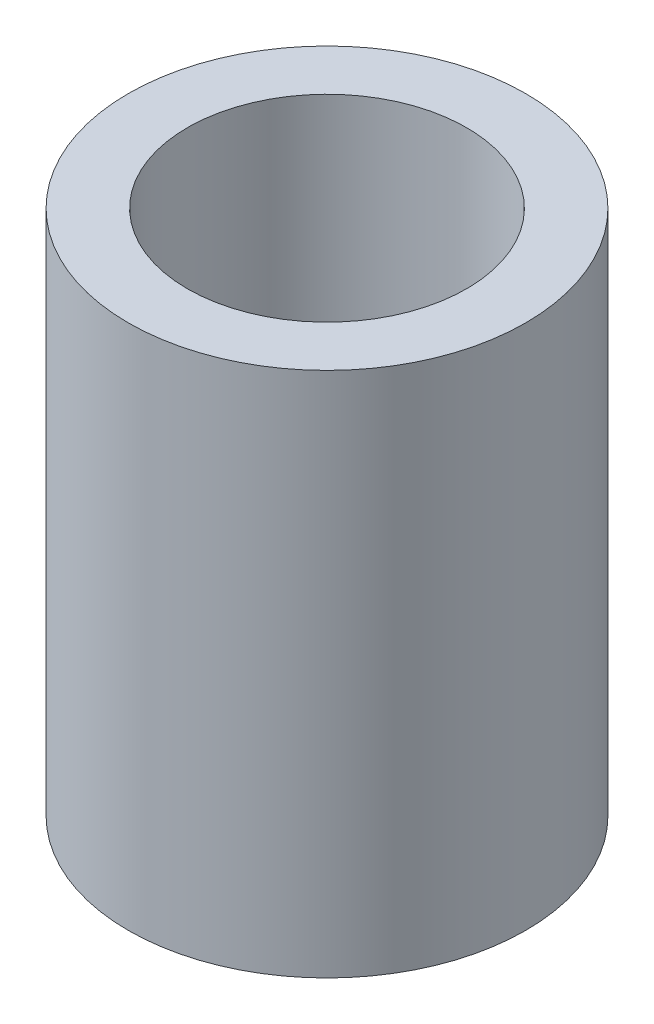
ISO-10303-21;
HEADER;
FILE_DESCRIPTION(('STEP AP214'),'2;1');
FILE_NAME('part.step','',(''),(''),'','','');
FILE_SCHEMA(('AUTOMOTIVE_DESIGN { 1 0 10303 214 1 1 1 1 }'));
ENDSEC;
DATA;
#1=APPLICATION_CONTEXT('core data for automotive mechanical design processes');
#2=APPLICATION_PROTOCOL_DEFINITION('international standard','automotive_design',2000,#1);
#3=PRODUCT_CONTEXT('',#1,'mechanical');
#4=PRODUCT('Part','Part','',(#3));
#5=PRODUCT_RELATED_PRODUCT_CATEGORY('part','',(#4));
#6=PRODUCT_DEFINITION_FORMATION('','',#4);
#7=PRODUCT_DEFINITION_CONTEXT('part definition',#1,'design');
#8=PRODUCT_DEFINITION('design','',#6,#7);
#9=PRODUCT_DEFINITION_SHAPE('','',#8);
#10=(LENGTH_UNIT() NAMED_UNIT(*) SI_UNIT(.MILLI.,.METRE.));
#11=(NAMED_UNIT(*) PLANE_ANGLE_UNIT() SI_UNIT($,.RADIAN.));
#12=(NAMED_UNIT(*) SI_UNIT($,.STERADIAN.) SOLID_ANGLE_UNIT());
#13=UNCERTAINTY_MEASURE_WITH_UNIT(LENGTH_MEASURE(1.E-05),#10,'distance_accuracy_value','');
#14=(GEOMETRIC_REPRESENTATION_CONTEXT(3) GLOBAL_UNCERTAINTY_ASSIGNED_CONTEXT((#13)) GLOBAL_UNIT_ASSIGNED_CONTEXT((#10,
#11,#12)) REPRESENTATION_CONTEXT('',''));
#15=CARTESIAN_POINT('',(0.,0.,0.));
#16=DIRECTION('',(0.,0.,1.));
#17=DIRECTION('',(1.,0.,0.));
#18=AXIS2_PLACEMENT_3D('',#15,#16,#17);
#19=CARTESIAN_POINT('',(0.,12.446,0.));
#20=DIRECTION('',(0.,1.,0.));
#21=DIRECTION('',(0.,0.,1.));
#22=AXIS2_PLACEMENT_3D('',#19,#20,#21);
#23=PLANE('',#22);
#24=CARTESIAN_POINT('',(0.,12.446,0.));
#25=DIRECTION('',(0.,1.,0.));
#26=DIRECTION('',(0.,0.,1.));
#27=AXIS2_PLACEMENT_3D('',#24,#25,#26);
#28=CIRCLE('',#27,4.699);
#29=CARTESIAN_POINT('',(0.,12.446,4.699));
#30=VERTEX_POINT('',#29);
#31=EDGE_CURVE('E12',#30,#30,#28,.T.);
#32=ORIENTED_EDGE('',*,*,#31,.T.);
#33=EDGE_LOOP('',(#32));
#34=FACE_BOUND('',#33,.T.);
#35=CARTESIAN_POINT('',(0.,12.446,0.));
#36=DIRECTION('',(0.,1.,0.));
#37=DIRECTION('',(0.,0.,1.));
#38=AXIS2_PLACEMENT_3D('',#35,#36,#37);
#39=CIRCLE('',#38,3.302);
#40=CARTESIAN_POINT('',(0.,12.446,3.302));
#41=VERTEX_POINT('',#40);
#42=EDGE_CURVE('E53',#41,#41,#39,.T.);
#43=ORIENTED_EDGE('',*,*,#42,.F.);
#44=EDGE_LOOP('',(#43));
#45=FACE_BOUND('',#44,.T.);
#46=ADVANCED_FACE('F42',(#34,#45),#23,.T.);
#47=CARTESIAN_POINT('',(0.,0.,0.));
#48=DIRECTION('',(0.,1.,0.));
#49=DIRECTION('',(0.,0.,1.));
#50=AXIS2_PLACEMENT_3D('',#47,#48,#49);
#51=PLANE('',#50);
#52=CARTESIAN_POINT('',(0.,0.,0.));
#53=DIRECTION('',(0.,1.,0.));
#54=DIRECTION('',(0.,0.,1.));
#55=AXIS2_PLACEMENT_3D('',#52,#53,#54);
#56=CIRCLE('',#55,4.699);
#57=CARTESIAN_POINT('',(0.,0.,4.699));
#58=VERTEX_POINT('',#57);
#59=EDGE_CURVE('E46',#58,#58,#56,.T.);
#60=ORIENTED_EDGE('',*,*,#59,.F.);
#61=EDGE_LOOP('',(#60));
#62=FACE_BOUND('',#61,.T.);
#63=CARTESIAN_POINT('',(0.,0.,0.));
#64=DIRECTION('',(0.,1.,0.));
#65=DIRECTION('',(0.,0.,1.));
#66=AXIS2_PLACEMENT_3D('',#63,#64,#65);
#67=CIRCLE('',#66,3.302);
#68=CARTESIAN_POINT('',(0.,0.,3.302));
#69=VERTEX_POINT('',#68);
#70=EDGE_CURVE('E55',#69,#69,#67,.T.);
#71=ORIENTED_EDGE('',*,*,#70,.T.);
#72=EDGE_LOOP('',(#71));
#73=FACE_BOUND('',#72,.T.);
#74=ADVANCED_FACE('F65',(#62,#73),#51,.F.);
#75=CARTESIAN_POINT('',(0.,12.446,0.));
#76=DIRECTION('',(0.,-1.,0.));
#77=DIRECTION('',(0.,0.,-1.));
#78=AXIS2_PLACEMENT_3D('',#75,#76,#77);
#79=CYLINDRICAL_SURFACE('',#78,4.699);
#80=ORIENTED_EDGE('',*,*,#31,.F.);
#81=EDGE_LOOP('',(#80));
#82=FACE_BOUND('',#81,.T.);
#83=ORIENTED_EDGE('',*,*,#59,.T.);
#84=EDGE_LOOP('',(#83));
#85=FACE_BOUND('',#84,.T.);
#86=ADVANCED_FACE('F44',(#82,#85),#79,.T.);
#87=CARTESIAN_POINT('',(0.,12.446,0.));
#88=DIRECTION('',(0.,-1.,0.));
#89=DIRECTION('',(0.,0.,-1.));
#90=AXIS2_PLACEMENT_3D('',#87,#88,#89);
#91=CYLINDRICAL_SURFACE('',#90,3.302);
#92=ORIENTED_EDGE('',*,*,#42,.T.);
#93=EDGE_LOOP('',(#92));
#94=FACE_BOUND('',#93,.T.);
#95=ORIENTED_EDGE('',*,*,#70,.F.);
#96=EDGE_LOOP('',(#95));
#97=FACE_BOUND('',#96,.T.);
#98=ADVANCED_FACE('F61',(#94,#97),#91,.F.);
#99=CLOSED_SHELL('',(#46,#74,#86,#98));
#100=MANIFOLD_SOLID_BREP('B2',#99);
#101=ADVANCED_BREP_SHAPE_REPRESENTATION('',(#18,#100),#14);
#102=SHAPE_DEFINITION_REPRESENTATION(#9,#101);
ENDSEC;
END-ISO-10303-21;
